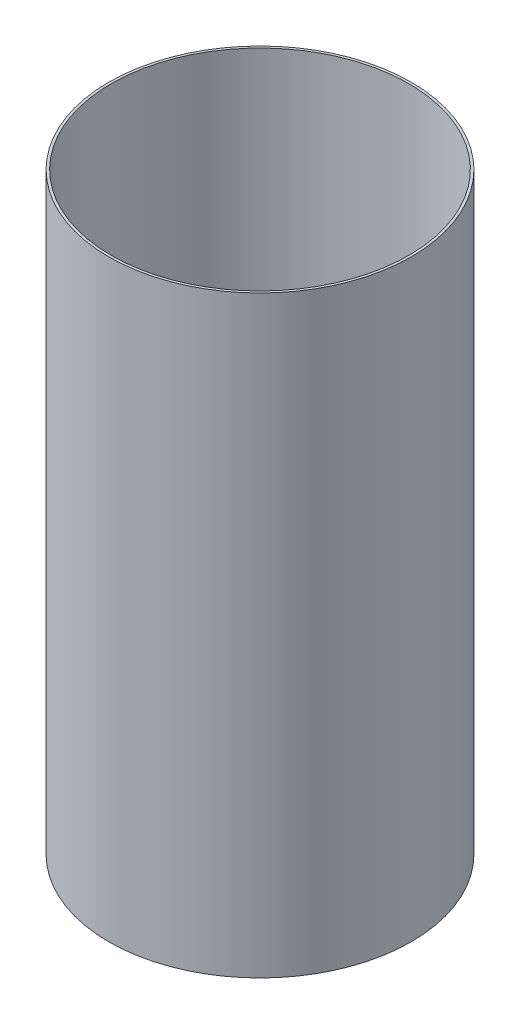
ISO-10303-21;
HEADER;
FILE_DESCRIPTION(('STEP AP214'),'2;1');
FILE_NAME('part.step','',(''),(''),'','','');
FILE_SCHEMA(('AUTOMOTIVE_DESIGN { 1 0 10303 214 1 1 1 1 }'));
ENDSEC;
DATA;
#1=APPLICATION_CONTEXT('core data for automotive mechanical design processes');
#2=APPLICATION_PROTOCOL_DEFINITION('international standard','automotive_design',2000,#1);
#3=PRODUCT_CONTEXT('',#1,'mechanical');
#4=PRODUCT('Part','Part','',(#3));
#5=PRODUCT_RELATED_PRODUCT_CATEGORY('part','',(#4));
#6=PRODUCT_DEFINITION_FORMATION('','',#4);
#7=PRODUCT_DEFINITION_CONTEXT('part definition',#1,'design');
#8=PRODUCT_DEFINITION('design','',#6,#7);
#9=PRODUCT_DEFINITION_SHAPE('','',#8);
#10=(LENGTH_UNIT() NAMED_UNIT(*) SI_UNIT(.MILLI.,.METRE.));
#11=(NAMED_UNIT(*) PLANE_ANGLE_UNIT() SI_UNIT($,.RADIAN.));
#12=(NAMED_UNIT(*) SI_UNIT($,.STERADIAN.) SOLID_ANGLE_UNIT());
#13=UNCERTAINTY_MEASURE_WITH_UNIT(LENGTH_MEASURE(1.E-05),#10,'distance_accuracy_value','');
#14=(GEOMETRIC_REPRESENTATION_CONTEXT(3) GLOBAL_UNCERTAINTY_ASSIGNED_CONTEXT((#13)) GLOBAL_UNIT_ASSIGNED_CONTEXT((#10,
#11,#12)) REPRESENTATION_CONTEXT('',''));
#15=CARTESIAN_POINT('',(0.,0.,0.));
#16=DIRECTION('',(0.,0.,1.));
#17=DIRECTION('',(1.,0.,0.));
#18=AXIS2_PLACEMENT_3D('',#15,#16,#17);
#19=CARTESIAN_POINT('',(0.,304.8,0.));
#20=DIRECTION('',(0.,-1.,0.));
#21=DIRECTION('',(0.,0.,-1.));
#22=AXIS2_PLACEMENT_3D('',#19,#20,#21);
#23=CYLINDRICAL_SURFACE('',#22,76.454);
#24=CARTESIAN_POINT('',(0.,304.8,0.));
#25=DIRECTION('',(0.,1.,0.));
#26=DIRECTION('',(0.,0.,1.));
#27=AXIS2_PLACEMENT_3D('',#24,#25,#26);
#28=CIRCLE('',#27,76.454);
#29=CARTESIAN_POINT('',(0.,304.8,76.454));
#30=VERTEX_POINT('',#29);
#31=EDGE_CURVE('E155',#30,#30,#28,.T.);
#32=ORIENTED_EDGE('',*,*,#31,.T.);
#33=EDGE_LOOP('',(#32));
#34=FACE_BOUND('',#33,.T.);
#35=CARTESIAN_POINT('',(0.,0.,0.));
#36=DIRECTION('',(0.,1.,0.));
#37=DIRECTION('',(0.,0.,1.));
#38=AXIS2_PLACEMENT_3D('',#35,#36,#37);
#39=CIRCLE('',#38,76.454);
#40=CARTESIAN_POINT('',(0.,0.,76.454));
#41=VERTEX_POINT('',#40);
#42=EDGE_CURVE('E157',#41,#41,#39,.T.);
#43=ORIENTED_EDGE('',*,*,#42,.F.);
#44=EDGE_LOOP('',(#43));
#45=FACE_BOUND('',#44,.T.);
#46=CARTESIAN_POINT('',(76.3826610691207,63.5,-3.30199999997547));
#47=CARTESIAN_POINT('',(76.3826620291474,63.6853819647287,-3.3019918079239));
#48=CARTESIAN_POINT('',(76.383343208903,63.8708961471971,-3.28633591577558));
#49=CARTESIAN_POINT('',(76.3859948755669,64.2368089863952,-3.22410227777121));
#50=CARTESIAN_POINT('',(76.3879668898774,64.4172013184378,-3.17748789879736));
#51=CARTESIAN_POINT('',(76.3929764278327,64.7675167530268,-3.05467247875228));
#52=CARTESIAN_POINT('',(76.3960134169275,64.937445057642,-2.97848627881866));
#53=CARTESIAN_POINT('',(76.4028100187327,65.2620541683877,-2.79871206477511));
#54=CARTESIAN_POINT('',(76.4065694585019,65.4167386102335,-2.69513060634747));
#55=CARTESIAN_POINT('',(76.4143907670657,65.706638200888,-2.4634137316045));
#56=CARTESIAN_POINT('',(76.4184528419951,65.8418398919869,-2.33526148407334));
#57=CARTESIAN_POINT('',(76.426419731489,66.0888217242942,-2.05807347076545));
#58=CARTESIAN_POINT('',(76.4303245396916,66.2006009187744,-1.90903686125707));
#59=CARTESIAN_POINT('',(76.4375382685382,66.3975980402252,-1.59424508850743));
#60=CARTESIAN_POINT('',(76.4408469666113,66.4828060549012,-1.42848371659406));
#61=CARTESIAN_POINT('',(76.4464936007809,66.6241782878362,-1.08499161396295));
#62=CARTESIAN_POINT('',(76.4488315428523,66.6803426848577,-0.907260956923397));
#63=CARTESIAN_POINT('',(76.4522718525213,66.761999397097,-0.544994018158061));
#64=CARTESIAN_POINT('',(76.4533749974034,66.7875110084857,-0.360462093380274));
#65=CARTESIAN_POINT('',(76.4542239903656,66.8071974918305,0.0102681530737689));
#66=CARTESIAN_POINT('',(76.4539698470391,66.801372562192,0.196466464191947));
#67=CARTESIAN_POINT('',(76.4521335635385,66.7585673933056,0.565113338096498));
#68=CARTESIAN_POINT('',(76.4505523092254,66.721607936634,0.747564319059276));
#69=CARTESIAN_POINT('',(76.4462409734375,66.6176150533942,1.10366983222531));
#70=CARTESIAN_POINT('',(76.4435108880496,66.5505815243899,1.27732433446441));
#71=CARTESIAN_POINT('',(76.4372079558978,66.3883195710236,1.61097443525883));
#72=CARTESIAN_POINT('',(76.4336348255127,66.293081655252,1.7709654123422));
#73=CARTESIAN_POINT('',(76.4260483099315,66.0771213438165,2.07269635076554));
#74=CARTESIAN_POINT('',(76.4220349224602,65.9563988164461,2.21443621777617));
#75=CARTESIAN_POINT('',(76.4140161217434,65.692778608665,2.47576263652141));
#76=CARTESIAN_POINT('',(76.4100107176869,65.549862899105,2.5953310018939));
#77=CARTESIAN_POINT('',(76.4024627443555,65.2459766066436,2.80878025224665));
#78=CARTESIAN_POINT('',(76.398920175182,65.0850060197816,2.90266113159207));
#79=CARTESIAN_POINT('',(76.3926975972809,64.7495686441656,3.06206874285322));
#80=CARTESIAN_POINT('',(76.3900176082251,64.5751015477244,3.12759482812473));
#81=CARTESIAN_POINT('',(76.385823181191,64.2176284553048,3.22842083712244));
#82=CARTESIAN_POINT('',(76.3843087366681,64.0346225072786,3.26372093056941));
#83=CARTESIAN_POINT('',(76.3826173774757,63.665424920344,3.30307049462596));
#84=CARTESIAN_POINT('',(76.3824393832152,63.4792359745758,3.30714518932298));
#85=CARTESIAN_POINT('',(76.3834381784881,63.1088184664324,3.28399407920064));
#86=CARTESIAN_POINT('',(76.3846149646976,62.9245898992482,3.25676835118167));
#87=CARTESIAN_POINT('',(76.3881896916623,62.5633933809551,3.17181014210494));
#88=CARTESIAN_POINT('',(76.3905871715552,62.3864227169144,3.11408917395115));
#89=CARTESIAN_POINT('',(76.3963326567538,62.0446820772379,2.9697906261413));
#90=CARTESIAN_POINT('',(76.3996806661417,61.8799121540043,2.88321292255437));
#91=CARTESIAN_POINT('',(76.4069524630315,61.5671340983362,2.68359367384693));
#92=CARTESIAN_POINT('',(76.4108766189776,61.4191368000678,2.57053516657557));
#93=CARTESIAN_POINT('',(76.4188570850451,61.1442140121443,2.32118845449955));
#94=CARTESIAN_POINT('',(76.4229133958096,61.0172886250378,2.1849001366512));
#95=CARTESIAN_POINT('',(76.4307041037124,60.7880280593379,1.89285430241895));
#96=CARTESIAN_POINT('',(76.4344382866719,60.6857091617063,1.7370839987422));
#97=CARTESIAN_POINT('',(76.4411608010755,60.5086773111976,1.41056076747722));
#98=CARTESIAN_POINT('',(76.4441491351477,60.4339642610451,1.23980789268605));
#99=CARTESIAN_POINT('',(76.4490421114858,60.314293456805,0.888227455273492));
#100=CARTESIAN_POINT('',(76.4509471349209,60.2693252359098,0.707403460854529));
#101=CARTESIAN_POINT('',(76.4534602897593,60.2103862818826,0.340763562523234));
#102=CARTESIAN_POINT('',(76.4540684260263,60.1964154324989,0.154947677335042));
#103=CARTESIAN_POINT('',(76.4539192899085,60.1998689968324,-0.216239472526039));
#104=CARTESIAN_POINT('',(76.4531631296525,60.2172678390186,-0.401610976112491));
#105=CARTESIAN_POINT('',(76.4503727436337,60.2829141210917,-0.766798818527518));
#106=CARTESIAN_POINT('',(76.448338515407,60.3311616204448,-0.946615146646812));
#107=CARTESIAN_POINT('',(76.4432209605501,60.4571308052011,-1.29559470314583));
#108=CARTESIAN_POINT('',(76.4401376213703,60.5348528431816,-1.46475780406242));
#109=CARTESIAN_POINT('',(76.433268865819,60.7175595775723,-1.78763408785813));
#110=CARTESIAN_POINT('',(76.4294834725184,60.8225433781507,-1.94134777818059));
#111=CARTESIAN_POINT('',(76.421633410251,61.0568820191316,-2.22908766158217));
#112=CARTESIAN_POINT('',(76.4175685456929,61.1862540405203,-2.36309985618926));
#113=CARTESIAN_POINT('',(76.4096187378743,61.4656975490021,-2.60754306188846));
#114=CARTESIAN_POINT('',(76.4057338392393,61.6157741338072,-2.71796824846074));
#115=CARTESIAN_POINT('',(76.3985800026208,61.9324610030019,-2.91214146432711));
#116=CARTESIAN_POINT('',(76.3953115817903,62.0990849914608,-2.99586713614349));
#117=CARTESIAN_POINT('',(76.3897678854118,62.4439128185894,-3.13405589560122));
#118=CARTESIAN_POINT('',(76.3874914329314,62.6221026447085,-3.18855367883622));
#119=CARTESIAN_POINT('',(76.3847934240444,62.9178391727415,-3.25238611047969));
#120=CARTESIAN_POINT('',(76.3839972966065,63.0334686793806,-3.27096770212809));
#121=CARTESIAN_POINT('',(76.3829308163531,63.2660479020064,-3.29577722817064));
#122=CARTESIAN_POINT('',(76.3826604632072,63.3829976171637,-3.30200517032501));
#123=CARTESIAN_POINT('',(76.3826610691207,63.5,-3.30199999997547));
#124=B_SPLINE_CURVE_WITH_KNOTS('',3,(#46,#47,#48,#49,#50,#51,#52,#53,#54,#55,#56,#57,#58,#59,
#60,#61,#62,#63,#64,#65,#66,#67,#68,#69,#70,#71,#72,#73,#74,#75,#76,#77,#78,#79,#80,#81,#82,#83,
#84,#85,#86,#87,#88,#89,#90,#91,#92,#93,#94,#95,#96,#97,#98,#99,#100,#101,#102,#103,#104,#105,
#106,#107,#108,#109,#110,#111,#112,#113,#114,#115,#116,#117,#118,#119,#120,#121,#122,#123),
.UNSPECIFIED.,.T.,.F.,(4,2,2,2,2,2,2,2,2,2,2,2,2,2,2,2,2,2,2,2,2,2,2,2,2,2,2,2,2,2,2,2,2,2,2,2,
2,2,4),(0.,0.555718802417623,1.11209636023126,1.66819505048001,2.22416078659022,
2.78050873384402,3.3368791641297,3.89345689903787,4.45003120818733,5.00625496553439,
5.56247520118791,6.11832444877085,6.67417558966048,7.23021399991582,7.7862552838942,
8.34275066714543,8.89924617246981,9.4557543682635,10.01225943921,10.5683149141753,
11.1243690247765,11.6802133574676,12.236060077371,12.7922638206389,13.3484702706493,
13.9050437300949,14.4616152283112,15.017990772124,15.5743642293128,16.1302843543681,
16.6862055510608,17.2421333979447,17.798042979139,18.3543456604024,18.9107855553248,
19.4676901823818,20.0239322523124,20.3746700655025,20.7254076583691),.UNSPECIFIED.);
#125=CARTESIAN_POINT('',(76.454,60.198,0.));
#126=VERTEX_POINT('',#125);
#127=CARTESIAN_POINT('',(76.454,66.802,0.));
#128=VERTEX_POINT('',#127);
#129=EDGE_CURVE('E112',#126,#128,#124,.T.);
#130=ORIENTED_EDGE('',*,*,#129,.T.);
#131=EDGE_CURVE('E121',#128,#126,#124,.T.);
#132=ORIENTED_EDGE('',*,*,#131,.T.);
#133=EDGE_LOOP('',(#130,#132));
#134=FACE_BOUND('',#133,.T.);
#135=CARTESIAN_POINT('',(-35.3317146512857,63.5,67.8003248945027));
#136=CARTESIAN_POINT('',(-35.3317222258238,63.6853819647287,67.8003216298845));
#137=CARTESIAN_POINT('',(-35.345621216021,63.8708961471971,67.7930836027833));
#138=CARTESIAN_POINT('',(-35.4008429608347,64.2368089863952,67.7642631944744));
#139=CARTESIAN_POINT('',(-35.4421982043629,64.4172013184378,67.7426638194769));
#140=CARTESIAN_POINT('',(-35.551064247076,64.7675167530268,67.6855944965849));
#141=CARTESIAN_POINT('',(-35.6185619261837,64.937445057642,67.6501315063252));
#142=CARTESIAN_POINT('',(-35.7776492633934,65.2620541683877,67.5661304291261));
#143=CARTESIAN_POINT('',(-35.8692331576374,65.4167386102335,67.5175954702564));
#144=CARTESIAN_POINT('',(-36.0738165119323,65.706638200888,67.408510484792));
#145=CARTESIAN_POINT('',(-36.186830651311,65.8418398919869,67.3479522211074));
#146=CARTESIAN_POINT('',(-36.4308659572071,66.0888217242942,67.2162577431443));
#147=CARTESIAN_POINT('',(-36.5618878512366,66.2006009187744,67.1451211014905));
#148=CARTESIAN_POINT('',(-36.8381123877634,66.3975980402252,66.9939724875528));
#149=CARTESIAN_POINT('',(-36.9833202958431,66.4828060549012,66.9139572181809));
#150=CARTESIAN_POINT('',(-37.2836164998058,66.6241782878362,66.7471012955021));
#151=CARTESIAN_POINT('',(-37.438704734869,66.6803426848577,66.6602606842087));
#152=CARTESIAN_POINT('',(-37.7541572616255,66.761999397097,66.4821066103963));
#153=CARTESIAN_POINT('',(-37.9145181687334,66.7875110084857,66.3907959994994));
#154=CARTESIAN_POINT('',(-38.2360044765949,66.8071974918305,66.2061661257452));
#155=CARTESIAN_POINT('',(-38.3971298725018,66.801372562192,66.1128468756092));
#156=CARTESIAN_POINT('',(-38.7154692885786,66.7585673933056,65.9269331704968));
#157=CARTESIAN_POINT('',(-38.8726858458812,66.721607936634,65.8343382736105));
#158=CARTESIAN_POINT('',(-39.1789265988167,66.6176150533942,65.6525517907109));
#159=CARTESIAN_POINT('',(-39.3279507665433,66.5505815243899,65.5633602162909));
#160=CARTESIAN_POINT('',(-39.6137487637306,66.3883195710236,65.3910766665319));
#161=CARTESIAN_POINT('',(-39.7505184490686,66.293081655252,65.3079867563057));
#162=CARTESIAN_POINT('',(-40.0080318490604,66.0771213438165,65.1505511718745));
#163=CARTESIAN_POINT('',(-40.1287754808849,65.9563988164461,65.0762055428638));
#164=CARTESIAN_POINT('',(-40.3510813978399,65.692778608665,64.9385978483625));
#165=CARTESIAN_POINT('',(-40.4526279377132,65.549862899105,64.875344884011));
#166=CARTESIAN_POINT('',(-40.6337064242717,65.2459766066436,64.7620835221825));
#167=CARTESIAN_POINT('',(-40.7132383661277,65.0850060197816,64.7120751276109));
#168=CARTESIAN_POINT('',(-40.8481781180859,64.7495686441656,64.6269824114409));
#169=CARTESIAN_POINT('',(-40.9035853780137,64.5751015477244,64.591898430201));
#170=CARTESIAN_POINT('',(-40.9888060496509,64.2176284553048,64.5378529453363));
#171=CARTESIAN_POINT('',(-41.0186196050704,64.0346225072786,64.5188913511833));
#172=CARTESIAN_POINT('',(-41.0518516475751,63.665424920344,64.4977518091275));
#173=CARTESIAN_POINT('',(-41.0552914395651,63.4792359745758,64.4955603142276));
#174=CARTESIAN_POINT('',(-41.0357413877098,63.1088184664324,64.5080008513684));
#175=CARTESIAN_POINT('',(-41.0127516087136,62.9245898992482,64.5226328421301));
#176=CARTESIAN_POINT('',(-40.9409630048754,62.5633933809551,64.5682077510314));
#177=CARTESIAN_POINT('',(-40.8921739200697,62.3864227169144,64.5991445136007));
#178=CARTESIAN_POINT('',(-40.7700804545365,62.0446820772379,64.6762695236447));
#179=CARTESIAN_POINT('',(-40.6967759685228,61.8799121540043,64.7224578366202));
#180=CARTESIAN_POINT('',(-40.5275365265027,61.5671340983362,64.8285650218116));
#181=CARTESIAN_POINT('',(-40.4315870650648,61.4191368000678,64.888492694185));
#182=CARTESIAN_POINT('',(-40.2196367110906,61.1442140121443,65.0200773365715));
#183=CARTESIAN_POINT('',(-40.1036357209771,61.0172886250378,65.0917343636634));
#184=CARTESIAN_POINT('',(-39.854611963414,60.7880280593379,65.2445042317368));
#185=CARTESIAN_POINT('',(-39.7215780147545,60.6857091617063,65.3256232808805));
#186=CARTESIAN_POINT('',(-39.442161858755,60.5086773111976,65.4947067647638));
#187=CARTESIAN_POINT('',(-39.2957796984527,60.4339642610451,65.582671175381));
#188=CARTESIAN_POINT('',(-38.9937485963488,60.314293456805,65.7626988358961));
#189=CARTESIAN_POINT('',(-38.8381029352858,60.2693252359098,65.8547606317952));
#190=CARTESIAN_POINT('',(-38.5218400467092,60.2103862818826,66.0402570368945));
#191=CARTESIAN_POINT('',(-38.361222837843,60.1964154324989,66.1336916409448));
#192=CARTESIAN_POINT('',(-38.0396907684461,60.1998689968324,66.3191560602087));
#193=CARTESIAN_POINT('',(-37.8787762570745,60.2172678390186,66.4111869580109));
#194=CARTESIAN_POINT('',(-37.5611191153804,60.2829141210917,66.5913643340397));
#195=CARTESIAN_POINT('',(-37.4043764931006,60.3311616204448,66.679510804778));
#196=CARTESIAN_POINT('',(-37.0995925543425,60.4571308052011,66.8495686505162));
#197=CARTESIAN_POINT('',(-36.9515513419759,60.5348528431816,66.9314799509163));
#198=CARTESIAN_POINT('',(-36.6684979001536,60.7175595775723,67.0869695760143));
#199=CARTESIAN_POINT('',(-36.5334852427747,60.8225433781507,67.160548174414));
#200=CARTESIAN_POINT('',(-36.2803701629332,61.0568820191316,67.2976197627699));
#201=CARTESIAN_POINT('',(-36.1622797657075,61.1862540405204,67.3611055841031));
#202=CARTESIAN_POINT('',(-35.9466108358802,61.4656975490021,67.4764424514267));
#203=CARTESIAN_POINT('',(-35.8490373697735,61.6157741338072,67.5282906238038));
#204=CARTESIAN_POINT('',(-35.6773015137894,61.9324610030019,67.6191818274908));
#205=CARTESIAN_POINT('',(-35.6031587446323,62.0990849914608,67.6582141279295));
#206=CARTESIAN_POINT('',(-35.4807119202352,62.4439128185894,67.7225075257638));
#207=CARTESIAN_POINT('',(-35.4323772292635,62.6221026447085,67.7477849517027));
#208=CARTESIAN_POINT('',(-35.3757477174314,62.9178391727415,67.7773646232887));
#209=CARTESIAN_POINT('',(-35.3592575233022,63.0334686793806,67.785965952527));
#210=CARTESIAN_POINT('',(-35.3372386033668,63.2660479020064,67.7974471165562));
#211=CARTESIAN_POINT('',(-35.3317098706749,63.3829976171637,67.8003269549411));
#212=CARTESIAN_POINT('',(-35.3317146512857,63.5,67.8003248945027));
#213=B_SPLINE_CURVE_WITH_KNOTS('',3,(#135,#136,#137,#138,#139,#140,#141,#142,#143,#144,#145,
#146,#147,#148,#149,#150,#151,#152,#153,#154,#155,#156,#157,#158,#159,#160,#161,#162,#163,#164,
#165,#166,#167,#168,#169,#170,#171,#172,#173,#174,#175,#176,#177,#178,#179,#180,#181,#182,#183,
#184,#185,#186,#187,#188,#189,#190,#191,#192,#193,#194,#195,#196,#197,#198,#199,#200,#201,#202,
#203,#204,#205,#206,#207,#208,#209,#210,#211,#212),.UNSPECIFIED.,.T.,.F.,(4,2,2,2,2,2,2,2,2,2,2,
2,2,2,2,2,2,2,2,2,2,2,2,2,2,2,2,2,2,2,2,2,2,2,2,2,2,2,4),(0.,0.555718802417624,1.11209636023126,
1.66819505048001,2.22416078659022,2.78050873384402,3.3368791641297,3.89345689903787,
4.45003120818733,5.00625496553438,5.5624752011879,6.11832444877085,6.67417558966047,
7.23021399991582,7.7862552838942,8.34275066714543,8.89924617246981,9.45575436826352,
10.01225943921,10.5683149141753,11.1243690247765,11.6802133574676,12.236060077371,
12.792263820639,13.3484702706493,13.9050437300948,14.4616152283112,15.017990772124,
15.5743642293128,16.1302843543681,16.6862055510608,17.2421333979447,17.798042979139,
18.3543456604024,18.9107855553248,19.4676901823818,20.0239322523124,20.3746700655026,
20.7254076583691),.UNSPECIFIED.);
#214=CARTESIAN_POINT('',(-38.2270000000003,60.198,66.2111062209353));
#215=VERTEX_POINT('',#214);
#216=CARTESIAN_POINT('',(-38.2270000000003,66.802,66.2111062209353));
#217=VERTEX_POINT('',#216);
#218=EDGE_CURVE('E116',#215,#217,#213,.T.);
#219=ORIENTED_EDGE('',*,*,#218,.T.);
#220=EDGE_CURVE('E84',#217,#215,#213,.T.);
#221=ORIENTED_EDGE('',*,*,#220,.T.);
#222=EDGE_LOOP('',(#219,#221));
#223=FACE_BOUND('',#222,.T.);
#224=CARTESIAN_POINT('',(-41.0509464178347,63.5,-64.4983248945278));
#225=CARTESIAN_POINT('',(-41.0509398033233,63.6853819647287,-64.4983298219611));
#226=CARTESIAN_POINT('',(-41.0377219928818,63.8708961471971,-64.5067476870082));
#227=CARTESIAN_POINT('',(-40.985151914732,64.2368089863952,-64.5401609167037));
#228=CARTESIAN_POINT('',(-40.9457686855142,64.4172013184378,-64.5651759206801));
#229=CARTESIAN_POINT('',(-40.8419121807564,64.7675167530268,-64.6309220178331));
#230=CARTESIAN_POINT('',(-40.7774514907435,64.937445057642,-64.6716452275071));
#231=CARTESIAN_POINT('',(-40.625160755339,65.2620541683877,-64.7674183643515));
#232=CARTESIAN_POINT('',(-40.5373363008642,65.4167386102335,-64.8224648639095));
#233=CARTESIAN_POINT('',(-40.3405742551331,65.706638200888,-64.9450967531881));
#234=CARTESIAN_POINT('',(-40.2316221906838,65.8418398919869,-65.0126907370347));
#235=CARTESIAN_POINT('',(-39.9955537742816,66.0888217242942,-65.1581842723794));
#236=CARTESIAN_POINT('',(-39.8684366884547,66.2006009187744,-65.236084240234));
#237=CARTESIAN_POINT('',(-39.5994258807745,66.3975980402252,-65.3997273990459));
#238=CARTESIAN_POINT('',(-39.4575266707679,66.4828060549012,-65.4854735015874));
#239=CARTESIAN_POINT('',(-39.1628771009748,66.6241782878362,-65.6621096815397));
#240=CARTESIAN_POINT('',(-39.010126807983,66.6803426848577,-65.7529997272859));
#241=CARTESIAN_POINT('',(-38.6981145908955,66.761999397097,-65.9371125922387));
#242=CARTESIAN_POINT('',(-38.5388568286697,66.7875110084857,-66.0303339061197));
#243=CARTESIAN_POINT('',(-38.2182195137703,66.8071974918305,-66.2164342788195));
#244=CARTESIAN_POINT('',(-38.056839974537,66.801372562192,-66.3093133398017));
#245=CARTESIAN_POINT('',(-37.7366642749596,66.7585673933056,-66.4920465085939));
#246=CARTESIAN_POINT('',(-37.5778664633439,66.721607936634,-66.5819025926703));
#247=CARTESIAN_POINT('',(-37.2673143746205,66.6176150533942,-66.7562216229367));
#248=CARTESIAN_POINT('',(-37.1155601215059,66.5505815243899,-66.8406845507558));
#249=CARTESIAN_POINT('',(-36.8234591921668,66.3883195710236,-67.0020511017912));
#250=CARTESIAN_POINT('',(-36.6831163764438,66.293081655252,-67.0789521686485));
#251=CARTESIAN_POINT('',(-36.4180164608709,66.0771213438165,-67.2232475226406));
#252=CARTESIAN_POINT('',(-36.2932594415749,65.9563988164461,-67.2906417606405));
#253=CARTESIAN_POINT('',(-36.0629347239032,65.6927786086649,-67.4143604848844));
#254=CARTESIAN_POINT('',(-35.9573827799734,65.549862899105,-67.4706758859054));
#255=CARTESIAN_POINT('',(-35.7687563200834,65.2459766066436,-67.5708637744296));
#256=CARTESIAN_POINT('',(-35.6856818090539,65.0850060197815,-67.6147362592034));
#257=CARTESIAN_POINT('',(-35.5445194791946,64.7495686441656,-67.6890511542946));
#258=CARTESIAN_POINT('',(-35.4864322302111,64.5751015477244,-67.7194932583262));
#259=CARTESIAN_POINT('',(-35.3970171315398,64.2176284553047,-67.7662737824592));
#260=CARTESIAN_POINT('',(-35.3656891315973,64.0346225072786,-67.7826122817532));
#261=CARTESIAN_POINT('',(-35.3307657299003,63.665424920344,-67.800822303754));
#262=CARTESIAN_POINT('',(-35.3271479436497,63.4792359745758,-67.8027055035511));
#263=CARTESIAN_POINT('',(-35.347696790778,63.1088184664324,-67.7919949305695));
#264=CARTESIAN_POINT('',(-35.3718633559837,62.9245898992482,-67.7794011933122));
#265=CARTESIAN_POINT('',(-35.4472266867865,62.5633933809551,-67.7400178931369));
#266=CARTESIAN_POINT('',(-35.4984132514852,62.3864227169144,-67.7132336875524));
#267=CARTESIAN_POINT('',(-35.626252202217,62.0446820772379,-67.6460601497865));
#268=CARTESIAN_POINT('',(-35.7029046976186,61.8799121540042,-67.605670759175));
#269=CARTESIAN_POINT('',(-35.8794159365285,61.5671340983362,-67.512158695659));
#270=CARTESIAN_POINT('',(-35.9792895539125,61.4191368000678,-67.4590278607611));
#271=CARTESIAN_POINT('',(-36.1992203739542,61.1442140121443,-67.3412657910716));
#272=CARTESIAN_POINT('',(-36.3192776748322,61.0172886250378,-67.2766345003151));
#273=CARTESIAN_POINT('',(-36.5760921402981,60.7880280593379,-67.1373585341563));
#274=CARTESIAN_POINT('',(-36.7128602719171,60.6857091617063,-67.0627072796232));
#275=CARTESIAN_POINT('',(-36.9989989423202,60.5086773111975,-66.9052675322416));
#276=CARTESIAN_POINT('',(-37.1483694366947,60.4339642610451,-66.8224790680675));
#277=CARTESIAN_POINT('',(-37.4552935151366,60.314293456805,-66.6509262911701));
#278=CARTESIAN_POINT('',(-37.6128441996348,60.2693252359098,-66.5621640926503));
#279=CARTESIAN_POINT('',(-37.9316202430498,60.2103862818827,-66.3810205994183));
#280=CARTESIAN_POINT('',(-38.092845588183,60.1964154324989,-66.2886393182804));
#281=CARTESIAN_POINT('',(-38.4142285214621,60.1998689968324,-66.1029165876832));
#282=CARTESIAN_POINT('',(-38.5743868725777,60.2172678390186,-66.009575981899));
#283=CARTESIAN_POINT('',(-38.8892536282529,60.2829141210917,-65.8245655155128));
#284=CARTESIAN_POINT('',(-39.0439620223062,60.3311616204448,-65.7328956581318));
#285=CARTESIAN_POINT('',(-39.3436284062073,60.4571308052011,-65.5539739473709));
#286=CARTESIAN_POINT('',(-39.4885862793941,60.5348528431816,-65.4667221468544));
#287=CARTESIAN_POINT('',(-39.7647709656651,60.7175595775723,-65.2993354881568));
#288=CARTESIAN_POINT('',(-39.8959982297435,60.8225433781507,-65.219200396234));
#289=CARTESIAN_POINT('',(-40.1412632473175,61.0568820191316,-65.0685321011883));
#290=CARTESIAN_POINT('',(-40.2552887799851,61.1862540405204,-64.9980057279144));
#291=CARTESIAN_POINT('',(-40.4630079019938,61.4656975490021,-64.8688993895388));
#292=CARTESIAN_POINT('',(-40.5566964694656,61.6157741338073,-64.8103223753436));
#293=CARTESIAN_POINT('',(-40.7212784888311,61.9324610030019,-64.7070403631642));
#294=CARTESIAN_POINT('',(-40.7921528371577,62.0990849914609,-64.6623469917866));
#295=CARTESIAN_POINT('',(-40.9090559651764,62.4439128185894,-64.5884516301631));
#296=CARTESIAN_POINT('',(-40.9551142036676,62.6221026447085,-64.559231272867));
#297=CARTESIAN_POINT('',(-41.0090457066127,62.9178391727415,-64.5249785128095));
#298=CARTESIAN_POINT('',(-41.024739773304,63.0334686793806,-64.5149982503995));
#299=CARTESIAN_POINT('',(-41.045692212986,63.2660479020064,-64.5016698883861));
#300=CARTESIAN_POINT('',(-41.050950592532,63.3829976171637,-64.4983217846166));
#301=CARTESIAN_POINT('',(-41.0509464178347,63.5,-64.4983248945278));
#302=B_SPLINE_CURVE_WITH_KNOTS('',3,(#224,#225,#226,#227,#228,#229,#230,#231,#232,#233,#234,
#235,#236,#237,#238,#239,#240,#241,#242,#243,#244,#245,#246,#247,#248,#249,#250,#251,#252,#253,
#254,#255,#256,#257,#258,#259,#260,#261,#262,#263,#264,#265,#266,#267,#268,#269,#270,#271,#272,
#273,#274,#275,#276,#277,#278,#279,#280,#281,#282,#283,#284,#285,#286,#287,#288,#289,#290,#291,
#292,#293,#294,#295,#296,#297,#298,#299,#300,#301),.UNSPECIFIED.,.T.,.F.,(4,2,2,2,2,2,2,2,2,2,2,
2,2,2,2,2,2,2,2,2,2,2,2,2,2,2,2,2,2,2,2,2,2,2,2,2,2,2,4),(0.,0.555718802417624,1.11209636023128,
1.66819505048003,2.22416078659024,2.78050873384403,3.33687916412972,3.89345689903789,
4.45003120818734,5.00625496553439,5.56247520118793,6.11832444877088,6.67417558966049,
7.23021399991584,7.78625528389423,8.34275066714545,8.89924617246982,9.45575436826353,
10.01225943921,10.5683149141753,11.1243690247765,11.6802133574676,12.236060077371,
12.792263820639,13.3484702706494,13.9050437300949,14.4616152283112,15.017990772124,
15.5743642293129,16.1302843543681,16.6862055510608,17.2421333979447,17.798042979139,
18.3543456604024,18.9107855553249,19.4676901823818,20.0239322523124,20.3746700655026,
20.7254076583691),.UNSPECIFIED.);
#303=CARTESIAN_POINT('',(-38.2269999999994,60.198,-66.2111062209358));
#304=VERTEX_POINT('',#303);
#305=CARTESIAN_POINT('',(-38.2269999999994,66.802,-66.2111062209358));
#306=VERTEX_POINT('',#305);
#307=EDGE_CURVE('E48',#304,#306,#302,.T.);
#308=ORIENTED_EDGE('',*,*,#307,.T.);
#309=EDGE_CURVE('E12',#306,#304,#302,.T.);
#310=ORIENTED_EDGE('',*,*,#309,.T.);
#311=EDGE_LOOP('',(#308,#310));
#312=FACE_BOUND('',#311,.T.);
#313=ADVANCED_FACE('F44',(#34,#45,#134,#223,#312),#23,.F.);
#314=CARTESIAN_POINT('',(0.,304.8,0.));
#315=DIRECTION('',(0.,1.,0.));
#316=DIRECTION('',(0.,0.,1.));
#317=AXIS2_PLACEMENT_3D('',#314,#315,#316);
#318=PLANE('',#317);
#319=CARTESIAN_POINT('',(0.,304.8,0.));
#320=DIRECTION('',(0.,1.,0.));
#321=DIRECTION('',(1.,0.,0.));
#322=AXIS2_PLACEMENT_3D('',#319,#320,#321);
#323=CIRCLE('',#322,77.724);
#324=CARTESIAN_POINT('',(77.724,304.8,0.));
#325=VERTEX_POINT('',#324);
#326=EDGE_CURVE('E149',#325,#325,#323,.T.);
#327=ORIENTED_EDGE('',*,*,#326,.T.);
#328=EDGE_LOOP('',(#327));
#329=FACE_BOUND('',#328,.T.);
#330=ORIENTED_EDGE('',*,*,#31,.F.);
#331=EDGE_LOOP('',(#330));
#332=FACE_BOUND('',#331,.T.);
#333=ADVANCED_FACE('F94',(#329,#332),#318,.T.);
#334=CARTESIAN_POINT('',(0.,0.,0.));
#335=DIRECTION('',(0.,1.,0.));
#336=DIRECTION('',(0.,0.,1.));
#337=AXIS2_PLACEMENT_3D('',#334,#335,#336);
#338=PLANE('',#337);
#339=CARTESIAN_POINT('',(0.,0.,0.));
#340=DIRECTION('',(0.,1.,0.));
#341=DIRECTION('',(1.,0.,0.));
#342=AXIS2_PLACEMENT_3D('',#339,#340,#341);
#343=CIRCLE('',#342,77.724);
#344=CARTESIAN_POINT('',(77.724,0.,0.));
#345=VERTEX_POINT('',#344);
#346=EDGE_CURVE('E151',#345,#345,#343,.T.);
#347=ORIENTED_EDGE('',*,*,#346,.F.);
#348=EDGE_LOOP('',(#347));
#349=FACE_BOUND('',#348,.T.);
#350=ORIENTED_EDGE('',*,*,#42,.T.);
#351=EDGE_LOOP('',(#350));
#352=FACE_BOUND('',#351,.T.);
#353=ADVANCED_FACE('F99',(#349,#352),#338,.F.);
#354=CARTESIAN_POINT('',(0.,304.8,0.));
#355=DIRECTION('',(0.,-1.,0.));
#356=DIRECTION('',(0.,0.,-1.));
#357=AXIS2_PLACEMENT_3D('',#354,#355,#356);
#358=CYLINDRICAL_SURFACE('',#357,77.724);
#359=ORIENTED_EDGE('',*,*,#326,.F.);
#360=EDGE_LOOP('',(#359));
#361=FACE_BOUND('',#360,.T.);
#362=ORIENTED_EDGE('',*,*,#346,.T.);
#363=EDGE_LOOP('',(#362));
#364=FACE_BOUND('',#363,.T.);
#365=ADVANCED_FACE('F46',(#361,#364),#358,.T.);
#366=CARTESIAN_POINT('',(73.914,63.5,2.45243934020706E-11));
#367=DIRECTION('',(1.,0.,0.));
#368=DIRECTION('',(0.,0.,-1.));
#369=AXIS2_PLACEMENT_3D('',#366,#367,#368);
#370=CYLINDRICAL_SURFACE('',#369,3.302);
#371=CARTESIAN_POINT('',(76.454,63.5,2.45243934020706E-11));
#372=DIRECTION('',(-1.,0.,0.));
#373=DIRECTION('',(0.,0.,1.));
#374=AXIS2_PLACEMENT_3D('',#371,#372,#373);
#375=CIRCLE('',#374,3.302);
#376=EDGE_CURVE('E141',#126,#128,#375,.T.);
#377=ORIENTED_EDGE('',*,*,#376,.F.);
#378=ORIENTED_EDGE('',*,*,#131,.F.);
#379=EDGE_LOOP('',(#377,#378));
#380=FACE_BOUND('',#379,.T.);
#381=ADVANCED_FACE('F130',(#380),#370,.F.);
#382=CARTESIAN_POINT('',(76.454,63.5,2.45243934020706E-11));
#383=DIRECTION('',(-1.,0.,0.));
#384=DIRECTION('',(0.,0.,1.));
#385=AXIS2_PLACEMENT_3D('',#382,#383,#384);
#386=PLANE('',#385);
#387=ORIENTED_EDGE('',*,*,#376,.T.);
#388=EDGE_CURVE('E143',#128,#126,#375,.T.);
#389=ORIENTED_EDGE('',*,*,#388,.T.);
#390=EDGE_LOOP('',(#387,#389));
#391=FACE_BOUND('',#390,.T.);
#392=ADVANCED_FACE('F128',(#391),#386,.T.);
#393=ORIENTED_EDGE('',*,*,#388,.F.);
#394=ORIENTED_EDGE('',*,*,#129,.F.);
#395=EDGE_LOOP('',(#393,#394));
#396=FACE_BOUND('',#395,.T.);
#397=ADVANCED_FACE('F106',(#396),#370,.F.);
#398=CARTESIAN_POINT('',(-36.9570000000215,63.5,64.0114016953106));
#399=DIRECTION('',(-0.500000000000004,0.,0.866025403784436));
#400=DIRECTION('',(0.866025403784436,0.,0.500000000000004));
#401=AXIS2_PLACEMENT_3D('',#398,#399,#400);
#402=CYLINDRICAL_SURFACE('',#401,3.302);
#403=CARTESIAN_POINT('',(-38.2270000000215,63.5,66.211106220923));
#404=DIRECTION('',(0.500000000000004,0.,-0.866025403784436));
#405=DIRECTION('',(-0.866025403784436,0.,-0.500000000000004));
#406=AXIS2_PLACEMENT_3D('',#403,#404,#405);
#407=CIRCLE('',#406,3.302);
#408=EDGE_CURVE('E92',#215,#217,#407,.T.);
#409=ORIENTED_EDGE('',*,*,#408,.F.);
#410=ORIENTED_EDGE('',*,*,#220,.F.);
#411=EDGE_LOOP('',(#409,#410));
#412=FACE_BOUND('',#411,.T.);
#413=ADVANCED_FACE('F127',(#412),#402,.F.);
#414=CARTESIAN_POINT('',(-38.2270000000215,63.5,66.211106220923));
#415=DIRECTION('',(0.500000000000004,0.,-0.866025403784436));
#416=DIRECTION('',(-0.866025403784436,0.,-0.500000000000004));
#417=AXIS2_PLACEMENT_3D('',#414,#415,#416);
#418=PLANE('',#417);
#419=ORIENTED_EDGE('',*,*,#408,.T.);
#420=EDGE_CURVE('E69',#217,#215,#407,.T.);
#421=ORIENTED_EDGE('',*,*,#420,.T.);
#422=EDGE_LOOP('',(#419,#421));
#423=FACE_BOUND('',#422,.T.);
#424=ADVANCED_FACE('F126',(#423),#418,.T.);
#425=ORIENTED_EDGE('',*,*,#420,.F.);
#426=ORIENTED_EDGE('',*,*,#218,.F.);
#427=EDGE_LOOP('',(#425,#426));
#428=FACE_BOUND('',#427,.T.);
#429=ADVANCED_FACE('F122',(#428),#402,.F.);
#430=CARTESIAN_POINT('',(-36.9569999999782,63.5,-64.0114016953356));
#431=DIRECTION('',(-0.499999999999992,0.,-0.866025403784443));
#432=DIRECTION('',(-0.866025403784443,0.,0.499999999999992));
#433=AXIS2_PLACEMENT_3D('',#430,#431,#432);
#434=CYLINDRICAL_SURFACE('',#433,3.302);
#435=CARTESIAN_POINT('',(-38.2269999999781,63.5,-66.2111062209481));
#436=DIRECTION('',(0.499999999999992,0.,0.866025403784443));
#437=DIRECTION('',(0.866025403784443,0.,-0.499999999999992));
#438=AXIS2_PLACEMENT_3D('',#435,#436,#437);
#439=CIRCLE('',#438,3.302);
#440=EDGE_CURVE('E87',#304,#306,#439,.T.);
#441=ORIENTED_EDGE('',*,*,#440,.F.);
#442=ORIENTED_EDGE('',*,*,#309,.F.);
#443=EDGE_LOOP('',(#441,#442));
#444=FACE_BOUND('',#443,.T.);
#445=ADVANCED_FACE('F88',(#444),#434,.F.);
#446=CARTESIAN_POINT('',(-38.2269999999781,63.5,-66.2111062209481));
#447=DIRECTION('',(0.499999999999992,0.,0.866025403784443));
#448=DIRECTION('',(0.866025403784443,0.,-0.499999999999992));
#449=AXIS2_PLACEMENT_3D('',#446,#447,#448);
#450=PLANE('',#449);
#451=ORIENTED_EDGE('',*,*,#440,.T.);
#452=EDGE_CURVE('E62',#306,#304,#439,.T.);
#453=ORIENTED_EDGE('',*,*,#452,.T.);
#454=EDGE_LOOP('',(#451,#453));
#455=FACE_BOUND('',#454,.T.);
#456=ADVANCED_FACE('F91',(#455),#450,.T.);
#457=ORIENTED_EDGE('',*,*,#452,.F.);
#458=ORIENTED_EDGE('',*,*,#307,.F.);
#459=EDGE_LOOP('',(#457,#458));
#460=FACE_BOUND('',#459,.T.);
#461=ADVANCED_FACE('F82',(#460),#434,.F.);
#462=CLOSED_SHELL('',(#313,#333,#353,#365,#381,#392,#397,#413,#424,#429,#445,#456,#461));
#463=MANIFOLD_SOLID_BREP('B2',#462);
#464=ADVANCED_BREP_SHAPE_REPRESENTATION('',(#18,#463),#14);
#465=SHAPE_DEFINITION_REPRESENTATION(#9,#464);
ENDSEC;
END-ISO-10303-21;
